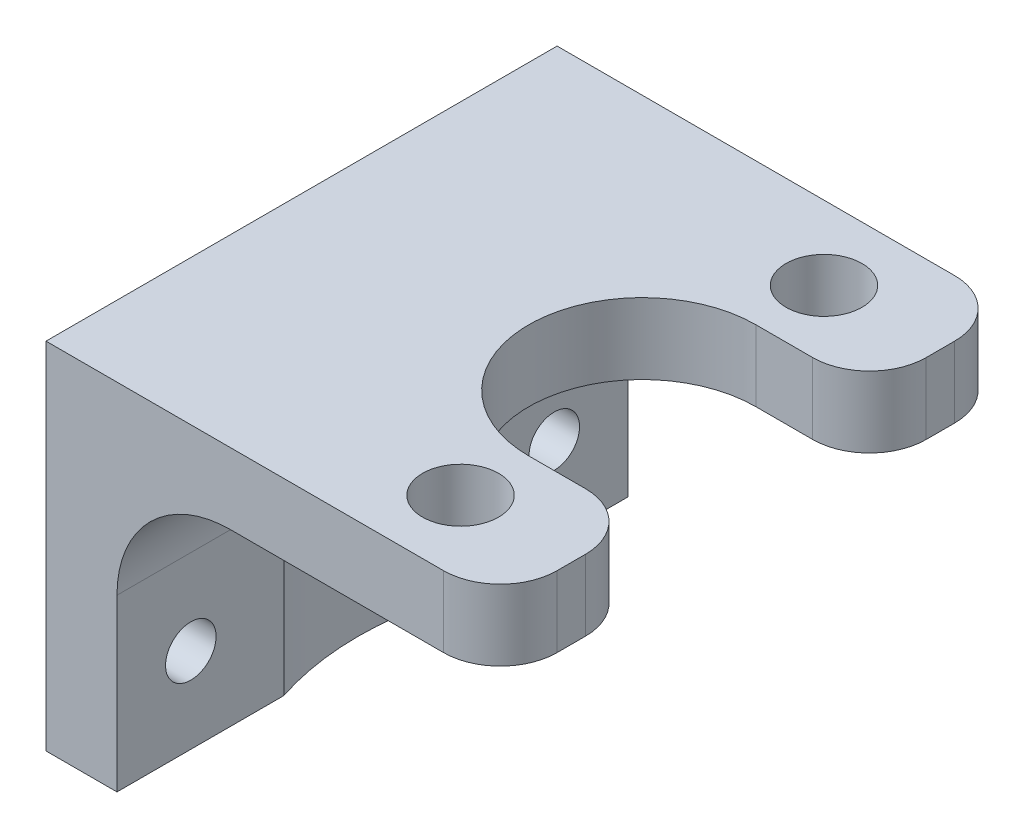
ISO-10303-21;
HEADER;
FILE_DESCRIPTION(('STEP AP214'),'2;1');
FILE_NAME('part.step','',(''),(''),'','','');
FILE_SCHEMA(('AUTOMOTIVE_DESIGN { 1 0 10303 214 1 1 1 1 }'));
ENDSEC;
DATA;
#1=APPLICATION_CONTEXT('core data for automotive mechanical design processes');
#2=APPLICATION_PROTOCOL_DEFINITION('international standard','automotive_design',2000,#1);
#3=PRODUCT_CONTEXT('',#1,'mechanical');
#4=PRODUCT('Part','Part','',(#3));
#5=PRODUCT_RELATED_PRODUCT_CATEGORY('part','',(#4));
#6=PRODUCT_DEFINITION_FORMATION('','',#4);
#7=PRODUCT_DEFINITION_CONTEXT('part definition',#1,'design');
#8=PRODUCT_DEFINITION('design','',#6,#7);
#9=PRODUCT_DEFINITION_SHAPE('','',#8);
#10=(LENGTH_UNIT() NAMED_UNIT(*) SI_UNIT(.MILLI.,.METRE.));
#11=(NAMED_UNIT(*) PLANE_ANGLE_UNIT() SI_UNIT($,.RADIAN.));
#12=(NAMED_UNIT(*) SI_UNIT($,.STERADIAN.) SOLID_ANGLE_UNIT());
#13=UNCERTAINTY_MEASURE_WITH_UNIT(LENGTH_MEASURE(1.E-05),#10,'distance_accuracy_value','');
#14=(GEOMETRIC_REPRESENTATION_CONTEXT(3) GLOBAL_UNCERTAINTY_ASSIGNED_CONTEXT((#13)) GLOBAL_UNIT_ASSIGNED_CONTEXT((#10,
#11,#12)) REPRESENTATION_CONTEXT('',''));
#15=CARTESIAN_POINT('',(0.,0.,0.));
#16=DIRECTION('',(0.,0.,1.));
#17=DIRECTION('',(1.,0.,0.));
#18=AXIS2_PLACEMENT_3D('',#15,#16,#17);
#19=CARTESIAN_POINT('',(-1.905,-5.08,0.));
#20=DIRECTION('',(0.,0.,-1.));
#21=DIRECTION('',(-1.,0.,0.));
#22=AXIS2_PLACEMENT_3D('',#19,#20,#21);
#23=CYLINDRICAL_SURFACE('',#22,5.08);
#24=CARTESIAN_POINT('',(-1.905,0.,10.6065911111912));
#25=CARTESIAN_POINT('',(-1.99596443418149,-1.01329915897046E-06,10.5466887844132));
#26=CARTESIAN_POINT('',(-2.0861340861637,-0.00244322260485966,10.4856266603058));
#27=CARTESIAN_POINT('',(-2.2646893735669,-0.0119611820117931,10.3613396064152));
#28=CARTESIAN_POINT('',(-2.35307545596892,-0.0190357559474637,10.2981152294927));
#29=CARTESIAN_POINT('',(-2.61498521640532,-0.0467997558229165,10.1056446793733));
#30=CARTESIAN_POINT('',(-2.78562618310901,-0.0740314872429836,9.97335996135179));
#31=CARTESIAN_POINT('',(-3.1164525826835,-0.143694699527984,9.70326650060102));
#32=CARTESIAN_POINT('',(-3.27672026630821,-0.185982956643509,9.56552032403289));
#33=CARTESIAN_POINT('',(-3.58800377820172,-0.284111933785825,9.28438076935319));
#34=CARTESIAN_POINT('',(-3.73901429962573,-0.33996033808965,9.14098422802204));
#35=CARTESIAN_POINT('',(-4.06981490398475,-0.47998002386457,8.81128907164102));
#36=CARTESIAN_POINT('',(-4.2467290444534,-0.56773724956672,8.62362562702776));
#37=CARTESIAN_POINT('',(-4.58488811251007,-0.759994574306441,8.24286416123916));
#38=CARTESIAN_POINT('',(-4.74612976084466,-0.864498165227075,8.04976501357092));
#39=CARTESIAN_POINT('',(-5.05379552996643,-1.08901683591521,7.65887541291587));
#40=CARTESIAN_POINT('',(-5.20013779323898,-1.20911013984939,7.46106571408954));
#41=CARTESIAN_POINT('',(-5.47720316470798,-1.46321811310087,7.06357616943074));
#42=CARTESIAN_POINT('',(-5.6079306595154,-1.59722885276305,6.86389686590006));
#43=CARTESIAN_POINT('',(-5.82593306848602,-1.84681048487803,6.51025343082133));
#44=CARTESIAN_POINT('',(-5.91631998386987,-1.95962070319113,6.35624482302585));
#45=CARTESIAN_POINT('',(-6.0879835611807,-2.19380045143656,6.04954609694954));
#46=CARTESIAN_POINT('',(-6.16925753232748,-2.31517249227548,5.89685638031667));
#47=CARTESIAN_POINT('',(-6.32222740764621,-2.56681466743316,5.59532490102736));
#48=CARTESIAN_POINT('',(-6.39396407059434,-2.6970430880394,5.44646911017335));
#49=CARTESIAN_POINT('',(-6.52790918307024,-2.96858646488772,5.15481040322741));
#50=CARTESIAN_POINT('',(-6.59012679801207,-3.10989055607807,5.01200176171065));
#51=CARTESIAN_POINT('',(-6.68913629538562,-3.36765875412946,4.7738275505998));
#52=CARTESIAN_POINT('',(-6.72830227313746,-3.48081904064943,4.67589764730949));
#53=CARTESIAN_POINT('',(-6.80034262995548,-3.71716453324485,4.48969576122306));
#54=CARTESIAN_POINT('',(-6.83321056337989,-3.84035982773388,4.40143371199532));
#55=CARTESIAN_POINT('',(-6.8853065363736,-4.07295302188119,4.25747491891597));
#56=CARTESIAN_POINT('',(-6.90594826794644,-4.18014942163848,4.19879822520508));
#57=CARTESIAN_POINT('',(-6.9408749970461,-4.40258079760138,4.0977333796737));
#58=CARTESIAN_POINT('',(-6.95519658126394,-4.51776491816841,4.05525167697404));
#59=CARTESIAN_POINT('',(-6.97188586213808,-4.70817710280017,4.00530569369846));
#60=CARTESIAN_POINT('',(-6.97673991680374,-4.78128583570145,3.99063981225697));
#61=CARTESIAN_POINT('',(-6.98332612700453,-4.92953586895697,3.97066741499163));
#62=CARTESIAN_POINT('',(-6.98503080272835,-5.00468930761968,3.96544329143358));
#63=CARTESIAN_POINT('',(-6.985,-5.08,3.96557372898299));
#64=B_SPLINE_CURVE_WITH_KNOTS('',3,(#24,#25,#26,#27,#28,#29,#30,#31,#32,#33,#34,#35,#36,#37,#38,
#39,#40,#41,#42,#43,#44,#45,#46,#47,#48,#49,#50,#51,#52,#53,#54,#55,#56,#57,#58,#59,#60,#61,#62,
#63),.UNSPECIFIED.,.F.,.F.,(4,2,2,2,2,2,2,2,2,2,2,2,2,2,2,2,2,2,2,4),(0.,0.326667923463672,
0.653252937509225,1.30511428610583,1.95093362836779,2.5971198018174,3.41324937170282,
4.22954933953037,5.05011615327995,5.87045190272281,6.50377907721026,7.13729276456552,
7.76800549759739,8.39810707448029,8.86169425554034,9.32575338331663,9.69656828582754,
10.0652074805127,10.2887386558922,10.5142111981198),.UNSPECIFIED.);
#65=CARTESIAN_POINT('',(-1.905,0.,10.6065911111912));
#66=VERTEX_POINT('',#65);
#67=CARTESIAN_POINT('',(-6.985,-5.08,3.96557372898299));
#68=VERTEX_POINT('',#67);
#69=EDGE_CURVE('E276',#66,#68,#64,.T.);
#70=ORIENTED_EDGE('',*,*,#69,.F.);
#71=DIRECTION('',(0.,0.,-1.));
#72=VECTOR('',#71,1.);
#73=CARTESIAN_POINT('',(-1.905,0.,0.));
#74=LINE('',#73,#72);
#75=CARTESIAN_POINT('',(-1.905,0.,11.43));
#76=VERTEX_POINT('',#75);
#77=EDGE_CURVE('E259',#76,#66,#74,.T.);
#78=ORIENTED_EDGE('',*,*,#77,.F.);
#79=CARTESIAN_POINT('',(-1.905,-5.08,11.43));
#80=DIRECTION('',(0.,0.,-1.));
#81=DIRECTION('',(-1.,0.,0.));
#82=AXIS2_PLACEMENT_3D('',#79,#80,#81);
#83=CIRCLE('',#82,5.08);
#84=CARTESIAN_POINT('',(-6.985,-5.08,11.43));
#85=VERTEX_POINT('',#84);
#86=EDGE_CURVE('E57',#76,#85,#83,.F.);
#87=ORIENTED_EDGE('',*,*,#86,.T.);
#88=DIRECTION('',(0.,0.,-1.));
#89=VECTOR('',#88,1.);
#90=CARTESIAN_POINT('',(-6.985,-5.08,11.43));
#91=LINE('',#90,#89);
#92=EDGE_CURVE('E262',#68,#85,#91,.F.);
#93=ORIENTED_EDGE('',*,*,#92,.F.);
#94=EDGE_LOOP('',(#70,#78,#87,#93));
#95=FACE_BOUND('',#94,.T.);
#96=ADVANCED_FACE('F49',(#95),#23,.F.);
#97=CARTESIAN_POINT('',(-6.985,-5.08,-3.965573728983));
#98=CARTESIAN_POINT('',(-6.98501243462539,-5.02313654218133,-3.96552254566352));
#99=CARTESIAN_POINT('',(-6.98404577354668,-4.96630906430899,-3.96847685033391));
#100=CARTESIAN_POINT('',(-6.98025489946552,-4.85342921322589,-3.97998947310891));
#101=CARTESIAN_POINT('',(-6.97743547061067,-4.79737522233663,-3.98853335775731));
#102=CARTESIAN_POINT('',(-6.97011176481025,-4.68754197022549,-4.01060201827622));
#103=CARTESIAN_POINT('',(-6.96564184081347,-4.63373964842225,-4.02402515567711));
#104=CARTESIAN_POINT('',(-6.95515507587846,-4.52756835071342,-4.05528297660954));
#105=CARTESIAN_POINT('',(-6.94913716928097,-4.47520038983758,-4.07312069889958));
#106=CARTESIAN_POINT('',(-6.92387138825496,-4.28128746319438,-4.14732822896197));
#107=CARTESIAN_POINT('',(-6.89998881141089,-4.14511330707712,-4.21623301029293));
#108=CARTESIAN_POINT('',(-6.84406366827373,-3.88411093667522,-4.37191441287979));
#109=CARTESIAN_POINT('',(-6.81194043205678,-3.7594124764202,-4.45886599231846));
#110=CARTESIAN_POINT('',(-6.7381720038089,-3.50992767732163,-4.65105394609583));
#111=CARTESIAN_POINT('',(-6.6959486891275,-3.38603922986691,-4.75721703069514));
#112=CARTESIAN_POINT('',(-6.60480659396756,-3.14750738494174,-4.97689626560496));
#113=CARTESIAN_POINT('',(-6.55588024156267,-3.03287467912632,-5.09042065394177));
#114=CARTESIAN_POINT('',(-6.45182327018049,-2.81112600465138,-5.32195246677524));
#115=CARTESIAN_POINT('',(-6.39668962329583,-2.70401374617602,-5.43996206039276));
#116=CARTESIAN_POINT('',(-6.28049732660413,-2.49628912440213,-5.67862113169921));
#117=CARTESIAN_POINT('',(-6.21944083229487,-2.39567441849384,-5.79926963672224));
#118=CARTESIAN_POINT('',(-6.0415104049458,-2.1238094639421,-6.13690828040322));
#119=CARTESIAN_POINT('',(-5.91827619969558,-1.95874436003302,-6.35557115633619));
#120=CARTESIAN_POINT('',(-5.65324384806655,-1.6450062202385,-6.79361271993009));
#121=CARTESIAN_POINT('',(-5.51143298944789,-1.49634453894597,-7.0129917965347));
#122=CARTESIAN_POINT('',(-5.20909683250229,-1.21582506629335,-7.44949327212334));
#123=CARTESIAN_POINT('',(-5.04857786037841,-1.08396162594724,-7.66661640706656));
#124=CARTESIAN_POINT('',(-4.70860032812132,-0.838522265570046,-8.0961883263207));
#125=CARTESIAN_POINT('',(-4.52915346915027,-0.724935155593786,-8.30863990153236));
#126=CARTESIAN_POINT('',(-4.2043466633807,-0.547522091522572,-8.66787017022752));
#127=CARTESIAN_POINT('',(-4.06357055896515,-0.478680721355011,-8.81633321809537));
#128=CARTESIAN_POINT('',(-3.77226558939357,-0.352962332949804,-9.10878550725363));
#129=CARTESIAN_POINT('',(-3.62173573239785,-0.296086533972524,-9.25277429135542));
#130=CARTESIAN_POINT('',(-3.31184578002247,-0.195985100213568,-9.5347074888234));
#131=CARTESIAN_POINT('',(-3.15252041982383,-0.15270973506796,-9.67267229642921));
#132=CARTESIAN_POINT('',(-2.82521002125021,-0.0812364278571495,-9.94195633346605));
#133=CARTESIAN_POINT('',(-2.65723124166651,-0.0530277517689098,-10.0732802335569));
#134=CARTESIAN_POINT('',(-2.39088753474402,-0.0223946207728884,-10.2708183973745));
#135=CARTESIAN_POINT('',(-2.29518650662456,-0.0140796503677234,-10.3397555459607));
#136=CARTESIAN_POINT('',(-2.10163732038624,-0.00288146443852575,-10.4751160628789));
#137=CARTESIAN_POINT('',(-2.00378803305032,-1.17829318203772E-06,-10.5415380566138));
#138=CARTESIAN_POINT('',(-1.90499999999999,0.,-10.6065911111912));
#139=B_SPLINE_CURVE_WITH_KNOTS('',3,(#97,#98,#99,#100,#101,#102,#103,#104,#105,#106,#107,#108,
#109,#110,#111,#112,#113,#114,#115,#116,#117,#118,#119,#120,#121,#122,#123,#124,#125,#126,#127,
#128,#129,#130,#131,#132,#133,#134,#135,#136,#137,#138),.UNSPECIFIED.,.F.,.F.,(4,2,2,2,2,2,2,2,
2,2,2,2,2,2,2,2,2,2,2,2,4),(0.,0.170447919280657,0.340457434671443,0.507111396928136,
0.67388039527551,1.13435083683149,1.59951344248259,2.10431202434874,2.60968561524757,
3.11530680341125,3.62074466665622,4.52081530958416,5.42150513165724,6.32189126173355,
7.2217240023538,7.8687986389446,8.51593917884467,9.16068513310825,9.80497113359638,
10.159530539132,10.5142810031246),.UNSPECIFIED.);
#140=CARTESIAN_POINT('',(-6.985,-5.08,-3.96557372898299));
#141=VERTEX_POINT('',#140);
#142=CARTESIAN_POINT('',(-1.90499999999999,0.,-10.6065911111912));
#143=VERTEX_POINT('',#142);
#144=EDGE_CURVE('E187',#141,#143,#139,.T.);
#145=ORIENTED_EDGE('',*,*,#144,.F.);
#146=CARTESIAN_POINT('',(-6.98499999999999,-5.08,-11.43));
#147=VERTEX_POINT('',#146);
#148=EDGE_CURVE('E186',#147,#141,#91,.F.);
#149=ORIENTED_EDGE('',*,*,#148,.F.);
#150=CARTESIAN_POINT('',(-1.90499999999999,-5.08,-11.43));
#151=DIRECTION('',(0.,0.,1.));
#152=DIRECTION('',(1.,0.,0.));
#153=AXIS2_PLACEMENT_3D('',#150,#151,#152);
#154=CIRCLE('',#153,5.08);
#155=CARTESIAN_POINT('',(-1.90499999999999,0.,-11.43));
#156=VERTEX_POINT('',#155);
#157=EDGE_CURVE('E13',#147,#156,#154,.F.);
#158=ORIENTED_EDGE('',*,*,#157,.T.);
#159=EDGE_CURVE('E263',#143,#156,#74,.T.);
#160=ORIENTED_EDGE('',*,*,#159,.F.);
#161=EDGE_LOOP('',(#145,#149,#158,#160));
#162=FACE_BOUND('',#161,.T.);
#163=ADVANCED_FACE('F300',(#162),#23,.F.);
#164=CARTESIAN_POINT('',(-6.985,-12.7,11.43));
#165=DIRECTION('',(-1.,0.,0.));
#166=DIRECTION('',(0.,0.,1.));
#167=AXIS2_PLACEMENT_3D('',#164,#165,#166);
#168=PLANE('',#167);
#169=CARTESIAN_POINT('',(-6.985,-8.89,8.128));
#170=DIRECTION('',(1.,0.,0.));
#171=DIRECTION('',(0.,0.,-1.));
#172=AXIS2_PLACEMENT_3D('',#169,#170,#171);
#173=CIRCLE('',#172,1.13029999999999);
#174=CARTESIAN_POINT('',(-6.985,-8.89,6.99770000000001));
#175=VERTEX_POINT('',#174);
#176=EDGE_CURVE('E377',#175,#175,#173,.T.);
#177=ORIENTED_EDGE('',*,*,#176,.F.);
#178=EDGE_LOOP('',(#177));
#179=FACE_BOUND('',#178,.T.);
#180=DIRECTION('',(0.,1.,0.));
#181=VECTOR('',#180,1.);
#182=CARTESIAN_POINT('',(-6.985,-12.7,3.96557372898299));
#183=LINE('',#182,#181);
#184=CARTESIAN_POINT('',(-6.985,-12.7,3.96557372898299));
#185=VERTEX_POINT('',#184);
#186=EDGE_CURVE('E64',#68,#185,#183,.F.);
#187=ORIENTED_EDGE('',*,*,#186,.F.);
#188=ORIENTED_EDGE('',*,*,#92,.T.);
#189=DIRECTION('',(0.,1.,0.));
#190=VECTOR('',#189,1.);
#191=CARTESIAN_POINT('',(-6.985,-12.7,11.43));
#192=LINE('',#191,#190);
#193=CARTESIAN_POINT('',(-6.985,-12.7,11.43));
#194=VERTEX_POINT('',#193);
#195=EDGE_CURVE('E197',#194,#85,#192,.T.);
#196=ORIENTED_EDGE('',*,*,#195,.F.);
#197=DIRECTION('',(0.,0.,1.));
#198=VECTOR('',#197,1.);
#199=CARTESIAN_POINT('',(-6.985,-12.7,11.43));
#200=LINE('',#199,#198);
#201=EDGE_CURVE('E194',#185,#194,#200,.T.);
#202=ORIENTED_EDGE('',*,*,#201,.F.);
#203=EDGE_LOOP('',(#187,#188,#196,#202));
#204=FACE_BOUND('',#203,.T.);
#205=ADVANCED_FACE('F275',(#179,#204),#168,.F.);
#206=CARTESIAN_POINT('',(-6.98499999999999,-8.89,-8.128));
#207=DIRECTION('',(1.,0.,0.));
#208=DIRECTION('',(0.,0.,-1.));
#209=AXIS2_PLACEMENT_3D('',#206,#207,#208);
#210=CIRCLE('',#209,1.13029999999999);
#211=CARTESIAN_POINT('',(-6.98499999999999,-8.89,-9.25829999999999));
#212=VERTEX_POINT('',#211);
#213=EDGE_CURVE('E369',#212,#212,#210,.T.);
#214=ORIENTED_EDGE('',*,*,#213,.F.);
#215=EDGE_LOOP('',(#214));
#216=FACE_BOUND('',#215,.T.);
#217=DIRECTION('',(0.,1.,0.));
#218=VECTOR('',#217,1.);
#219=CARTESIAN_POINT('',(-6.985,-12.7,-3.96557372898299));
#220=LINE('',#219,#218);
#221=CARTESIAN_POINT('',(-6.985,-12.7,-3.96557372898299));
#222=VERTEX_POINT('',#221);
#223=EDGE_CURVE('E173',#222,#141,#220,.T.);
#224=ORIENTED_EDGE('',*,*,#223,.F.);
#225=CARTESIAN_POINT('',(-6.98499999999999,-12.7,-11.43));
#226=VERTEX_POINT('',#225);
#227=EDGE_CURVE('E185',#226,#222,#200,.T.);
#228=ORIENTED_EDGE('',*,*,#227,.F.);
#229=DIRECTION('',(0.,1.,0.));
#230=VECTOR('',#229,1.);
#231=CARTESIAN_POINT('',(-6.98499999999999,-12.7,-11.43));
#232=LINE('',#231,#230);
#233=EDGE_CURVE('E215',#226,#147,#232,.T.);
#234=ORIENTED_EDGE('',*,*,#233,.T.);
#235=ORIENTED_EDGE('',*,*,#148,.T.);
#236=EDGE_LOOP('',(#224,#228,#234,#235));
#237=FACE_BOUND('',#236,.T.);
#238=ADVANCED_FACE('F183',(#216,#237),#168,.F.);
#239=CARTESIAN_POINT('',(7.62,3.175,-7.62));
#240=DIRECTION('',(0.,-1.,0.));
#241=DIRECTION('',(0.,0.,-1.));
#242=AXIS2_PLACEMENT_3D('',#239,#240,#241);
#243=CYLINDRICAL_SURFACE('',#242,2.54);
#244=DIRECTION('',(0.,-1.,0.));
#245=VECTOR('',#244,1.);
#246=CARTESIAN_POINT('',(10.16,3.175,-7.62));
#247=LINE('',#246,#245);
#248=CARTESIAN_POINT('',(10.16,3.175,-7.62000000000001));
#249=VERTEX_POINT('',#248);
#250=CARTESIAN_POINT('',(10.16,0.,-7.62000000000001));
#251=VERTEX_POINT('',#250);
#252=EDGE_CURVE('E419',#249,#251,#247,.T.);
#253=ORIENTED_EDGE('',*,*,#252,.F.);
#254=CARTESIAN_POINT('',(7.62,3.175,-7.62));
#255=DIRECTION('',(0.,-1.,0.));
#256=DIRECTION('',(0.,0.,-1.));
#257=AXIS2_PLACEMENT_3D('',#254,#255,#256);
#258=CIRCLE('',#257,2.54);
#259=CARTESIAN_POINT('',(7.62,3.175,-5.08));
#260=VERTEX_POINT('',#259);
#261=EDGE_CURVE('E413',#260,#249,#258,.F.);
#262=ORIENTED_EDGE('',*,*,#261,.F.);
#263=DIRECTION('',(0.,-1.,0.));
#264=VECTOR('',#263,1.);
#265=CARTESIAN_POINT('',(7.62,3.175,-5.08));
#266=LINE('',#265,#264);
#267=CARTESIAN_POINT('',(7.62,0.,-5.08));
#268=VERTEX_POINT('',#267);
#269=EDGE_CURVE('E418',#268,#260,#266,.F.);
#270=ORIENTED_EDGE('',*,*,#269,.F.);
#271=CARTESIAN_POINT('',(7.62,0.,-7.62));
#272=DIRECTION('',(0.,-1.,0.));
#273=DIRECTION('',(0.,0.,-1.));
#274=AXIS2_PLACEMENT_3D('',#271,#272,#273);
#275=CIRCLE('',#274,2.54);
#276=EDGE_CURVE('E249',#251,#268,#275,.T.);
#277=ORIENTED_EDGE('',*,*,#276,.F.);
#278=EDGE_LOOP('',(#253,#262,#270,#277));
#279=FACE_BOUND('',#278,.T.);
#280=ADVANCED_FACE('F345',(#279),#243,.T.);
#281=CARTESIAN_POINT('',(7.62,3.175,7.62));
#282=DIRECTION('',(0.,1.,0.));
#283=DIRECTION('',(0.,0.,1.));
#284=AXIS2_PLACEMENT_3D('',#281,#282,#283);
#285=CYLINDRICAL_SURFACE('',#284,2.54);
#286=DIRECTION('',(0.,1.,0.));
#287=VECTOR('',#286,1.);
#288=CARTESIAN_POINT('',(10.16,3.175,7.62));
#289=LINE('',#288,#287);
#290=CARTESIAN_POINT('',(10.16,0.,7.62));
#291=VERTEX_POINT('',#290);
#292=CARTESIAN_POINT('',(10.16,3.175,7.62));
#293=VERTEX_POINT('',#292);
#294=EDGE_CURVE('E431',#291,#293,#289,.T.);
#295=ORIENTED_EDGE('',*,*,#294,.F.);
#296=CARTESIAN_POINT('',(7.62,0.,7.62));
#297=DIRECTION('',(0.,-1.,0.));
#298=DIRECTION('',(0.,0.,-1.));
#299=AXIS2_PLACEMENT_3D('',#296,#297,#298);
#300=CIRCLE('',#299,2.54);
#301=CARTESIAN_POINT('',(7.62,0.,5.08));
#302=VERTEX_POINT('',#301);
#303=EDGE_CURVE('E426',#302,#291,#300,.T.);
#304=ORIENTED_EDGE('',*,*,#303,.F.);
#305=DIRECTION('',(0.,1.,0.));
#306=VECTOR('',#305,1.);
#307=CARTESIAN_POINT('',(7.62,3.175,5.08));
#308=LINE('',#307,#306);
#309=CARTESIAN_POINT('',(7.62,3.175,5.08));
#310=VERTEX_POINT('',#309);
#311=EDGE_CURVE('E428',#310,#302,#308,.F.);
#312=ORIENTED_EDGE('',*,*,#311,.F.);
#313=CARTESIAN_POINT('',(7.62,3.175,7.62));
#314=DIRECTION('',(0.,-1.,0.));
#315=DIRECTION('',(0.,0.,-1.));
#316=AXIS2_PLACEMENT_3D('',#313,#314,#315);
#317=CIRCLE('',#316,2.54);
#318=EDGE_CURVE('E422',#293,#310,#317,.F.);
#319=ORIENTED_EDGE('',*,*,#318,.F.);
#320=EDGE_LOOP('',(#295,#304,#312,#319));
#321=FACE_BOUND('',#320,.T.);
#322=ADVANCED_FACE('F343',(#321),#285,.T.);
#323=CARTESIAN_POINT('',(10.16,3.175,11.43));
#324=DIRECTION('',(-1.,0.,0.));
#325=DIRECTION('',(0.,0.,1.));
#326=AXIS2_PLACEMENT_3D('',#323,#324,#325);
#327=PLANE('',#326);
#328=DIRECTION('',(0.,0.,-1.));
#329=VECTOR('',#328,1.);
#330=CARTESIAN_POINT('',(10.16,0.,11.43));
#331=LINE('',#330,#329);
#332=CARTESIAN_POINT('',(10.16,0.,8.89));
#333=VERTEX_POINT('',#332);
#334=EDGE_CURVE('E237',#333,#291,#331,.T.);
#335=ORIENTED_EDGE('',*,*,#334,.T.);
#336=ORIENTED_EDGE('',*,*,#294,.T.);
#337=DIRECTION('',(0.,0.,-1.));
#338=VECTOR('',#337,1.);
#339=CARTESIAN_POINT('',(10.16,3.175,11.43));
#340=LINE('',#339,#338);
#341=CARTESIAN_POINT('',(10.16,3.175,8.89));
#342=VERTEX_POINT('',#341);
#343=EDGE_CURVE('E225',#342,#293,#340,.T.);
#344=ORIENTED_EDGE('',*,*,#343,.F.);
#345=DIRECTION('',(0.,-1.,0.));
#346=VECTOR('',#345,1.);
#347=CARTESIAN_POINT('',(10.16,3.175,8.89));
#348=LINE('',#347,#346);
#349=EDGE_CURVE('E442',#342,#333,#348,.T.);
#350=ORIENTED_EDGE('',*,*,#349,.T.);
#351=EDGE_LOOP('',(#335,#336,#344,#350));
#352=FACE_BOUND('',#351,.T.);
#353=ADVANCED_FACE('F335',(#352),#327,.F.);
#354=CARTESIAN_POINT('',(7.62,3.175,8.89));
#355=DIRECTION('',(0.,-1.,0.));
#356=DIRECTION('',(0.,0.,-1.));
#357=AXIS2_PLACEMENT_3D('',#354,#355,#356);
#358=CYLINDRICAL_SURFACE('',#357,2.54);
#359=ORIENTED_EDGE('',*,*,#349,.F.);
#360=CARTESIAN_POINT('',(7.62,3.175,8.89));
#361=DIRECTION('',(0.,-1.,0.));
#362=DIRECTION('',(0.,0.,-1.));
#363=AXIS2_PLACEMENT_3D('',#360,#361,#362);
#364=CIRCLE('',#363,2.54);
#365=CARTESIAN_POINT('',(7.62,3.175,11.43));
#366=VERTEX_POINT('',#365);
#367=EDGE_CURVE('E437',#366,#342,#364,.F.);
#368=ORIENTED_EDGE('',*,*,#367,.F.);
#369=DIRECTION('',(0.,-1.,0.));
#370=VECTOR('',#369,1.);
#371=CARTESIAN_POINT('',(7.62,3.175,11.43));
#372=LINE('',#371,#370);
#373=CARTESIAN_POINT('',(7.62,0.,11.43));
#374=VERTEX_POINT('',#373);
#375=EDGE_CURVE('E439',#374,#366,#372,.F.);
#376=ORIENTED_EDGE('',*,*,#375,.F.);
#377=CARTESIAN_POINT('',(7.62,0.,8.89));
#378=DIRECTION('',(0.,-1.,0.));
#379=DIRECTION('',(0.,0.,-1.));
#380=AXIS2_PLACEMENT_3D('',#377,#378,#379);
#381=CIRCLE('',#380,2.54);
#382=EDGE_CURVE('E434',#333,#374,#381,.T.);
#383=ORIENTED_EDGE('',*,*,#382,.F.);
#384=EDGE_LOOP('',(#359,#368,#376,#383));
#385=FACE_BOUND('',#384,.T.);
#386=ADVANCED_FACE('F338',(#385),#358,.T.);
#387=CARTESIAN_POINT('',(7.62,3.175,-8.89));
#388=DIRECTION('',(0.,1.,0.));
#389=DIRECTION('',(0.,0.,1.));
#390=AXIS2_PLACEMENT_3D('',#387,#388,#389);
#391=CYLINDRICAL_SURFACE('',#390,2.54);
#392=DIRECTION('',(0.,1.,0.));
#393=VECTOR('',#392,1.);
#394=CARTESIAN_POINT('',(10.16,3.175,-8.89));
#395=LINE('',#394,#393);
#396=CARTESIAN_POINT('',(10.16,0.,-8.89));
#397=VERTEX_POINT('',#396);
#398=CARTESIAN_POINT('',(10.16,3.175,-8.89));
#399=VERTEX_POINT('',#398);
#400=EDGE_CURVE('E453',#397,#399,#395,.T.);
#401=ORIENTED_EDGE('',*,*,#400,.F.);
#402=CARTESIAN_POINT('',(7.62,0.,-8.89));
#403=DIRECTION('',(0.,-1.,0.));
#404=DIRECTION('',(0.,0.,-1.));
#405=AXIS2_PLACEMENT_3D('',#402,#403,#404);
#406=CIRCLE('',#405,2.54);
#407=CARTESIAN_POINT('',(7.62000000000001,0.,-11.43));
#408=VERTEX_POINT('',#407);
#409=EDGE_CURVE('E447',#408,#397,#406,.T.);
#410=ORIENTED_EDGE('',*,*,#409,.F.);
#411=DIRECTION('',(0.,1.,0.));
#412=VECTOR('',#411,1.);
#413=CARTESIAN_POINT('',(7.62,3.175,-11.43));
#414=LINE('',#413,#412);
#415=CARTESIAN_POINT('',(7.62000000000001,3.175,-11.43));
#416=VERTEX_POINT('',#415);
#417=EDGE_CURVE('E450',#416,#408,#414,.F.);
#418=ORIENTED_EDGE('',*,*,#417,.F.);
#419=CARTESIAN_POINT('',(7.62,3.175,-8.89));
#420=DIRECTION('',(0.,-1.,0.));
#421=DIRECTION('',(0.,0.,-1.));
#422=AXIS2_PLACEMENT_3D('',#419,#420,#421);
#423=CIRCLE('',#422,2.54);
#424=EDGE_CURVE('E445',#399,#416,#423,.F.);
#425=ORIENTED_EDGE('',*,*,#424,.F.);
#426=EDGE_LOOP('',(#401,#410,#418,#425));
#427=FACE_BOUND('',#426,.T.);
#428=ADVANCED_FACE('F333',(#427),#391,.T.);
#429=EDGE_CURVE('E229',#249,#399,#340,.T.);
#430=ORIENTED_EDGE('',*,*,#429,.F.);
#431=ORIENTED_EDGE('',*,*,#252,.T.);
#432=EDGE_CURVE('E222',#251,#397,#331,.T.);
#433=ORIENTED_EDGE('',*,*,#432,.T.);
#434=ORIENTED_EDGE('',*,*,#400,.T.);
#435=EDGE_LOOP('',(#430,#431,#433,#434));
#436=FACE_BOUND('',#435,.T.);
#437=ADVANCED_FACE('F330',(#436),#327,.F.);
#438=CARTESIAN_POINT('',(-10.16,3.175,-11.43));
#439=DIRECTION('',(0.,0.,1.));
#440=DIRECTION('',(1.,0.,0.));
#441=AXIS2_PLACEMENT_3D('',#438,#439,#440);
#442=PLANE('',#441);
#443=DIRECTION('',(-1.,0.,0.));
#444=VECTOR('',#443,1.);
#445=CARTESIAN_POINT('',(-10.16,3.175,-11.43));
#446=LINE('',#445,#444);
#447=CARTESIAN_POINT('',(-10.16,3.175,-11.43));
#448=VERTEX_POINT('',#447);
#449=EDGE_CURVE('E228',#416,#448,#446,.T.);
#450=ORIENTED_EDGE('',*,*,#449,.F.);
#451=ORIENTED_EDGE('',*,*,#417,.T.);
#452=DIRECTION('',(-1.,0.,0.));
#453=VECTOR('',#452,1.);
#454=CARTESIAN_POINT('',(-10.16,0.,-11.43));
#455=LINE('',#454,#453);
#456=EDGE_CURVE('E240',#408,#156,#455,.T.);
#457=ORIENTED_EDGE('',*,*,#456,.T.);
#458=ORIENTED_EDGE('',*,*,#157,.F.);
#459=ORIENTED_EDGE('',*,*,#233,.F.);
#460=DIRECTION('',(1.,0.,0.));
#461=VECTOR('',#460,1.);
#462=CARTESIAN_POINT('',(-10.16,-12.7,-11.43));
#463=LINE('',#462,#461);
#464=CARTESIAN_POINT('',(-10.16,-12.7,-11.43));
#465=VERTEX_POINT('',#464);
#466=EDGE_CURVE('E192',#465,#226,#463,.T.);
#467=ORIENTED_EDGE('',*,*,#466,.F.);
#468=DIRECTION('',(0.,-1.,0.));
#469=VECTOR('',#468,1.);
#470=CARTESIAN_POINT('',(-10.16,3.175,-11.43));
#471=LINE('',#470,#469);
#472=EDGE_CURVE('E456',#448,#465,#471,.T.);
#473=ORIENTED_EDGE('',*,*,#472,.F.);
#474=EDGE_LOOP('',(#450,#451,#457,#458,#459,#467,#473));
#475=FACE_BOUND('',#474,.T.);
#476=ADVANCED_FACE('F326',(#475),#442,.F.);
#477=CARTESIAN_POINT('',(-10.16,3.175,11.43));
#478=DIRECTION('',(1.,0.,0.));
#479=DIRECTION('',(0.,0.,-1.));
#480=AXIS2_PLACEMENT_3D('',#477,#478,#479);
#481=PLANE('',#480);
#482=CARTESIAN_POINT('',(-10.16,-8.89,8.128));
#483=DIRECTION('',(1.,0.,0.));
#484=DIRECTION('',(0.,0.,-1.));
#485=AXIS2_PLACEMENT_3D('',#482,#483,#484);
#486=CIRCLE('',#485,1.1303);
#487=CARTESIAN_POINT('',(-10.16,-8.89,6.9977));
#488=VERTEX_POINT('',#487);
#489=EDGE_CURVE('E374',#488,#488,#486,.T.);
#490=ORIENTED_EDGE('',*,*,#489,.T.);
#491=EDGE_LOOP('',(#490));
#492=FACE_BOUND('',#491,.T.);
#493=CARTESIAN_POINT('',(-10.16,-8.89,-8.128));
#494=DIRECTION('',(1.,0.,0.));
#495=DIRECTION('',(0.,0.,-1.));
#496=AXIS2_PLACEMENT_3D('',#493,#494,#495);
#497=CIRCLE('',#496,1.1303);
#498=CARTESIAN_POINT('',(-10.16,-8.89,-9.2583));
#499=VERTEX_POINT('',#498);
#500=EDGE_CURVE('E366',#499,#499,#497,.T.);
#501=ORIENTED_EDGE('',*,*,#500,.T.);
#502=EDGE_LOOP('',(#501));
#503=FACE_BOUND('',#502,.T.);
#504=ORIENTED_EDGE('',*,*,#472,.T.);
#505=DIRECTION('',(0.,0.,-1.));
#506=VECTOR('',#505,1.);
#507=CARTESIAN_POINT('',(-10.16,-12.7,11.43));
#508=LINE('',#507,#506);
#509=CARTESIAN_POINT('',(-10.16,-12.7,11.43));
#510=VERTEX_POINT('',#509);
#511=EDGE_CURVE('E278',#510,#465,#508,.T.);
#512=ORIENTED_EDGE('',*,*,#511,.F.);
#513=DIRECTION('',(0.,-1.,0.));
#514=VECTOR('',#513,1.);
#515=CARTESIAN_POINT('',(-10.16,3.175,11.43));
#516=LINE('',#515,#514);
#517=CARTESIAN_POINT('',(-10.16,3.175,11.43));
#518=VERTEX_POINT('',#517);
#519=EDGE_CURVE('E236',#518,#510,#516,.T.);
#520=ORIENTED_EDGE('',*,*,#519,.F.);
#521=DIRECTION('',(0.,0.,1.));
#522=VECTOR('',#521,1.);
#523=CARTESIAN_POINT('',(-10.16,3.175,11.43));
#524=LINE('',#523,#522);
#525=EDGE_CURVE('E231',#448,#518,#524,.T.);
#526=ORIENTED_EDGE('',*,*,#525,.F.);
#527=EDGE_LOOP('',(#504,#512,#520,#526));
#528=FACE_BOUND('',#527,.T.);
#529=ADVANCED_FACE('F323',(#492,#503,#528),#481,.F.);
#530=CARTESIAN_POINT('',(-10.16,3.175,11.43));
#531=DIRECTION('',(0.,0.,-1.));
#532=DIRECTION('',(-1.,0.,0.));
#533=AXIS2_PLACEMENT_3D('',#530,#531,#532);
#534=PLANE('',#533);
#535=ORIENTED_EDGE('',*,*,#86,.F.);
#536=DIRECTION('',(1.,0.,0.));
#537=VECTOR('',#536,1.);
#538=CARTESIAN_POINT('',(-10.16,0.,11.43));
#539=LINE('',#538,#537);
#540=EDGE_CURVE('E248',#76,#374,#539,.T.);
#541=ORIENTED_EDGE('',*,*,#540,.T.);
#542=ORIENTED_EDGE('',*,*,#375,.T.);
#543=DIRECTION('',(1.,0.,0.));
#544=VECTOR('',#543,1.);
#545=CARTESIAN_POINT('',(-10.16,3.175,11.43));
#546=LINE('',#545,#544);
#547=EDGE_CURVE('E233',#518,#366,#546,.T.);
#548=ORIENTED_EDGE('',*,*,#547,.F.);
#549=ORIENTED_EDGE('',*,*,#519,.T.);
#550=DIRECTION('',(-1.,0.,0.));
#551=VECTOR('',#550,1.);
#552=CARTESIAN_POINT('',(-10.16,-12.7,11.43));
#553=LINE('',#552,#551);
#554=EDGE_CURVE('E193',#194,#510,#553,.T.);
#555=ORIENTED_EDGE('',*,*,#554,.F.);
#556=ORIENTED_EDGE('',*,*,#195,.T.);
#557=EDGE_LOOP('',(#535,#541,#542,#548,#549,#555,#556));
#558=FACE_BOUND('',#557,.T.);
#559=ADVANCED_FACE('F273',(#558),#534,.F.);
#560=CARTESIAN_POINT('',(0.,3.175,0.));
#561=DIRECTION('',(0.,-1.,0.));
#562=DIRECTION('',(0.,0.,-1.));
#563=AXIS2_PLACEMENT_3D('',#560,#561,#562);
#564=PLANE('',#563);
#565=CARTESIAN_POINT('',(5.08,3.175,8.128));
#566=DIRECTION('',(0.,-1.,0.));
#567=DIRECTION('',(0.,0.,-1.));
#568=AXIS2_PLACEMENT_3D('',#565,#566,#567);
#569=CIRCLE('',#568,1.7);
#570=CARTESIAN_POINT('',(5.08,3.175,6.428));
#571=VERTEX_POINT('',#570);
#572=EDGE_CURVE('E386',#571,#571,#569,.T.);
#573=ORIENTED_EDGE('',*,*,#572,.T.);
#574=EDGE_LOOP('',(#573));
#575=FACE_BOUND('',#574,.T.);
#576=CARTESIAN_POINT('',(5.08,3.175,-8.128));
#577=DIRECTION('',(0.,-1.,0.));
#578=DIRECTION('',(0.,0.,-1.));
#579=AXIS2_PLACEMENT_3D('',#576,#577,#578);
#580=CIRCLE('',#579,1.7);
#581=CARTESIAN_POINT('',(5.08,3.175,-9.828));
#582=VERTEX_POINT('',#581);
#583=EDGE_CURVE('E380',#582,#582,#580,.T.);
#584=ORIENTED_EDGE('',*,*,#583,.T.);
#585=EDGE_LOOP('',(#584));
#586=FACE_BOUND('',#585,.T.);
#587=DIRECTION('',(1.,0.,0.));
#588=VECTOR('',#587,1.);
#589=CARTESIAN_POINT('',(5.08,3.175,-5.08));
#590=LINE('',#589,#588);
#591=CARTESIAN_POINT('',(5.08,3.175,-5.08));
#592=VERTEX_POINT('',#591);
#593=EDGE_CURVE('E205',#592,#260,#590,.T.);
#594=ORIENTED_EDGE('',*,*,#593,.T.);
#595=ORIENTED_EDGE('',*,*,#261,.T.);
#596=ORIENTED_EDGE('',*,*,#429,.T.);
#597=ORIENTED_EDGE('',*,*,#424,.T.);
#598=ORIENTED_EDGE('',*,*,#449,.T.);
#599=ORIENTED_EDGE('',*,*,#525,.T.);
#600=ORIENTED_EDGE('',*,*,#547,.T.);
#601=ORIENTED_EDGE('',*,*,#367,.T.);
#602=ORIENTED_EDGE('',*,*,#343,.T.);
#603=ORIENTED_EDGE('',*,*,#318,.T.);
#604=DIRECTION('',(-1.,0.,0.));
#605=VECTOR('',#604,1.);
#606=CARTESIAN_POINT('',(5.08,3.175,5.08));
#607=LINE('',#606,#605);
#608=CARTESIAN_POINT('',(5.08,3.175,5.08));
#609=VERTEX_POINT('',#608);
#610=EDGE_CURVE('E209',#310,#609,#607,.T.);
#611=ORIENTED_EDGE('',*,*,#610,.T.);
#612=CARTESIAN_POINT('',(5.08,3.175,0.));
#613=DIRECTION('',(0.,-1.,0.));
#614=DIRECTION('',(0.,0.,-1.));
#615=AXIS2_PLACEMENT_3D('',#612,#613,#614);
#616=CIRCLE('',#615,5.08);
#617=EDGE_CURVE('E202',#609,#592,#616,.T.);
#618=ORIENTED_EDGE('',*,*,#617,.T.);
#619=EDGE_LOOP('',(#594,#595,#596,#597,#598,#599,#600,#601,#602,#603,#611,#618));
#620=FACE_BOUND('',#619,.T.);
#621=ADVANCED_FACE('F314',(#575,#586,#620),#564,.F.);
#622=CARTESIAN_POINT('',(0.,0.,0.));
#623=DIRECTION('',(0.,-1.,0.));
#624=DIRECTION('',(0.,0.,-1.));
#625=AXIS2_PLACEMENT_3D('',#622,#623,#624);
#626=PLANE('',#625);
#627=CARTESIAN_POINT('',(5.08,0.,8.128));
#628=DIRECTION('',(0.,-1.,0.));
#629=DIRECTION('',(0.,0.,-1.));
#630=AXIS2_PLACEMENT_3D('',#627,#628,#629);
#631=CIRCLE('',#630,1.7);
#632=CARTESIAN_POINT('',(5.08,0.,6.428));
#633=VERTEX_POINT('',#632);
#634=EDGE_CURVE('E389',#633,#633,#631,.T.);
#635=ORIENTED_EDGE('',*,*,#634,.F.);
#636=EDGE_LOOP('',(#635));
#637=FACE_BOUND('',#636,.T.);
#638=CARTESIAN_POINT('',(5.08,0.,-8.128));
#639=DIRECTION('',(0.,-1.,0.));
#640=DIRECTION('',(0.,0.,-1.));
#641=AXIS2_PLACEMENT_3D('',#638,#639,#640);
#642=CIRCLE('',#641,1.7);
#643=CARTESIAN_POINT('',(5.08,0.,-9.828));
#644=VERTEX_POINT('',#643);
#645=EDGE_CURVE('E383',#644,#644,#642,.T.);
#646=ORIENTED_EDGE('',*,*,#645,.F.);
#647=EDGE_LOOP('',(#646));
#648=FACE_BOUND('',#647,.T.);
#649=ORIENTED_EDGE('',*,*,#77,.T.);
#650=CARTESIAN_POINT('',(5.08,0.,0.));
#651=DIRECTION('',(0.,-1.,0.));
#652=DIRECTION('',(0.,0.,-1.));
#653=AXIS2_PLACEMENT_3D('',#650,#651,#652);
#654=CIRCLE('',#653,12.7);
#655=EDGE_CURVE('E178',#66,#143,#654,.T.);
#656=ORIENTED_EDGE('',*,*,#655,.T.);
#657=ORIENTED_EDGE('',*,*,#159,.T.);
#658=ORIENTED_EDGE('',*,*,#456,.F.);
#659=ORIENTED_EDGE('',*,*,#409,.T.);
#660=ORIENTED_EDGE('',*,*,#432,.F.);
#661=ORIENTED_EDGE('',*,*,#276,.T.);
#662=DIRECTION('',(1.,0.,0.));
#663=VECTOR('',#662,1.);
#664=CARTESIAN_POINT('',(5.08,0.,-5.08));
#665=LINE('',#664,#663);
#666=CARTESIAN_POINT('',(5.08,0.,-5.08));
#667=VERTEX_POINT('',#666);
#668=EDGE_CURVE('E214',#667,#268,#665,.T.);
#669=ORIENTED_EDGE('',*,*,#668,.F.);
#670=CARTESIAN_POINT('',(5.08,0.,0.));
#671=DIRECTION('',(0.,-1.,0.));
#672=DIRECTION('',(0.,0.,-1.));
#673=AXIS2_PLACEMENT_3D('',#670,#671,#672);
#674=CIRCLE('',#673,5.08);
#675=CARTESIAN_POINT('',(5.08,0.,5.08));
#676=VERTEX_POINT('',#675);
#677=EDGE_CURVE('E212',#676,#667,#674,.T.);
#678=ORIENTED_EDGE('',*,*,#677,.F.);
#679=DIRECTION('',(-1.,0.,0.));
#680=VECTOR('',#679,1.);
#681=CARTESIAN_POINT('',(5.08,0.,5.08));
#682=LINE('',#681,#680);
#683=EDGE_CURVE('E206',#302,#676,#682,.T.);
#684=ORIENTED_EDGE('',*,*,#683,.F.);
#685=ORIENTED_EDGE('',*,*,#303,.T.);
#686=ORIENTED_EDGE('',*,*,#334,.F.);
#687=ORIENTED_EDGE('',*,*,#382,.T.);
#688=ORIENTED_EDGE('',*,*,#540,.F.);
#689=EDGE_LOOP('',(#649,#656,#657,#658,#659,#660,#661,#669,#678,#684,#685,#686,#687,#688));
#690=FACE_BOUND('',#689,.T.);
#691=ADVANCED_FACE('F312',(#637,#648,#690),#626,.T.);
#692=CARTESIAN_POINT('',(5.08,3.175,0.));
#693=DIRECTION('',(0.,-1.,0.));
#694=DIRECTION('',(0.,0.,-1.));
#695=AXIS2_PLACEMENT_3D('',#692,#693,#694);
#696=CYLINDRICAL_SURFACE('',#695,5.08);
#697=ORIENTED_EDGE('',*,*,#677,.T.);
#698=DIRECTION('',(0.,-1.,0.));
#699=VECTOR('',#698,1.);
#700=CARTESIAN_POINT('',(5.08,3.175,-5.08));
#701=LINE('',#700,#699);
#702=EDGE_CURVE('E211',#592,#667,#701,.T.);
#703=ORIENTED_EDGE('',*,*,#702,.F.);
#704=ORIENTED_EDGE('',*,*,#617,.F.);
#705=DIRECTION('',(0.,-1.,0.));
#706=VECTOR('',#705,1.);
#707=CARTESIAN_POINT('',(5.08,3.175,5.08));
#708=LINE('',#707,#706);
#709=EDGE_CURVE('E219',#609,#676,#708,.T.);
#710=ORIENTED_EDGE('',*,*,#709,.T.);
#711=EDGE_LOOP('',(#697,#703,#704,#710));
#712=FACE_BOUND('',#711,.T.);
#713=ADVANCED_FACE('F305',(#712),#696,.F.);
#714=CARTESIAN_POINT('',(5.08,3.175,5.08));
#715=DIRECTION('',(0.,0.,1.));
#716=DIRECTION('',(1.,0.,0.));
#717=AXIS2_PLACEMENT_3D('',#714,#715,#716);
#718=PLANE('',#717);
#719=ORIENTED_EDGE('',*,*,#610,.F.);
#720=ORIENTED_EDGE('',*,*,#311,.T.);
#721=ORIENTED_EDGE('',*,*,#683,.T.);
#722=ORIENTED_EDGE('',*,*,#709,.F.);
#723=EDGE_LOOP('',(#719,#720,#721,#722));
#724=FACE_BOUND('',#723,.T.);
#725=ADVANCED_FACE('F302',(#724),#718,.F.);
#726=CARTESIAN_POINT('',(5.08,3.175,-5.08));
#727=DIRECTION('',(0.,0.,-1.));
#728=DIRECTION('',(-1.,0.,0.));
#729=AXIS2_PLACEMENT_3D('',#726,#727,#728);
#730=PLANE('',#729);
#731=ORIENTED_EDGE('',*,*,#668,.T.);
#732=ORIENTED_EDGE('',*,*,#269,.T.);
#733=ORIENTED_EDGE('',*,*,#593,.F.);
#734=ORIENTED_EDGE('',*,*,#702,.T.);
#735=EDGE_LOOP('',(#731,#732,#733,#734));
#736=FACE_BOUND('',#735,.T.);
#737=ADVANCED_FACE('F297',(#736),#730,.F.);
#738=CARTESIAN_POINT('',(0.,-12.7,0.));
#739=DIRECTION('',(0.,-1.,0.));
#740=DIRECTION('',(0.,0.,-1.));
#741=AXIS2_PLACEMENT_3D('',#738,#739,#740);
#742=PLANE('',#741);
#743=ORIENTED_EDGE('',*,*,#227,.T.);
#744=CARTESIAN_POINT('',(5.08,-12.7,0.));
#745=DIRECTION('',(0.,-1.,0.));
#746=DIRECTION('',(0.,0.,-1.));
#747=AXIS2_PLACEMENT_3D('',#744,#745,#746);
#748=CIRCLE('',#747,12.7);
#749=EDGE_CURVE('E170',#185,#222,#748,.T.);
#750=ORIENTED_EDGE('',*,*,#749,.F.);
#751=ORIENTED_EDGE('',*,*,#201,.T.);
#752=ORIENTED_EDGE('',*,*,#554,.T.);
#753=ORIENTED_EDGE('',*,*,#511,.T.);
#754=ORIENTED_EDGE('',*,*,#466,.T.);
#755=EDGE_LOOP('',(#743,#750,#751,#752,#753,#754));
#756=FACE_BOUND('',#755,.T.);
#757=ADVANCED_FACE('F189',(#756),#742,.T.);
#758=CARTESIAN_POINT('',(5.08,-12.7,0.));
#759=DIRECTION('',(0.,1.,0.));
#760=DIRECTION('',(0.,0.,1.));
#761=AXIS2_PLACEMENT_3D('',#758,#759,#760);
#762=CYLINDRICAL_SURFACE('',#761,12.7);
#763=ORIENTED_EDGE('',*,*,#69,.T.);
#764=ORIENTED_EDGE('',*,*,#186,.T.);
#765=ORIENTED_EDGE('',*,*,#749,.T.);
#766=ORIENTED_EDGE('',*,*,#223,.T.);
#767=ORIENTED_EDGE('',*,*,#144,.T.);
#768=ORIENTED_EDGE('',*,*,#655,.F.);
#769=EDGE_LOOP('',(#763,#764,#765,#766,#767,#768));
#770=FACE_BOUND('',#769,.T.);
#771=ADVANCED_FACE('F172',(#770),#762,.F.);
#772=CARTESIAN_POINT('',(-6.985,-8.89,-8.128));
#773=DIRECTION('',(1.,0.,0.));
#774=DIRECTION('',(0.,0.,-1.));
#775=AXIS2_PLACEMENT_3D('',#772,#773,#774);
#776=CYLINDRICAL_SURFACE('',#775,1.13029999999999);
#777=ORIENTED_EDGE('',*,*,#500,.F.);
#778=EDGE_LOOP('',(#777));
#779=FACE_BOUND('',#778,.T.);
#780=ORIENTED_EDGE('',*,*,#213,.T.);
#781=EDGE_LOOP('',(#780));
#782=FACE_BOUND('',#781,.T.);
#783=ADVANCED_FACE('F292',(#779,#782),#776,.F.);
#784=CARTESIAN_POINT('',(-6.985,-8.89,8.128));
#785=DIRECTION('',(1.,0.,0.));
#786=DIRECTION('',(0.,0.,-1.));
#787=AXIS2_PLACEMENT_3D('',#784,#785,#786);
#788=CYLINDRICAL_SURFACE('',#787,1.13029999999999);
#789=ORIENTED_EDGE('',*,*,#489,.F.);
#790=EDGE_LOOP('',(#789));
#791=FACE_BOUND('',#790,.T.);
#792=ORIENTED_EDGE('',*,*,#176,.T.);
#793=EDGE_LOOP('',(#792));
#794=FACE_BOUND('',#793,.T.);
#795=ADVANCED_FACE('F399',(#791,#794),#788,.F.);
#796=CARTESIAN_POINT('',(5.08,0.,-8.128));
#797=DIRECTION('',(0.,-1.,0.));
#798=DIRECTION('',(0.,0.,-1.));
#799=AXIS2_PLACEMENT_3D('',#796,#797,#798);
#800=CYLINDRICAL_SURFACE('',#799,1.7);
#801=ORIENTED_EDGE('',*,*,#583,.F.);
#802=EDGE_LOOP('',(#801));
#803=FACE_BOUND('',#802,.T.);
#804=ORIENTED_EDGE('',*,*,#645,.T.);
#805=EDGE_LOOP('',(#804));
#806=FACE_BOUND('',#805,.T.);
#807=ADVANCED_FACE('F397',(#803,#806),#800,.F.);
#808=CARTESIAN_POINT('',(5.08,0.,8.128));
#809=DIRECTION('',(0.,-1.,0.));
#810=DIRECTION('',(0.,0.,-1.));
#811=AXIS2_PLACEMENT_3D('',#808,#809,#810);
#812=CYLINDRICAL_SURFACE('',#811,1.7);
#813=ORIENTED_EDGE('',*,*,#572,.F.);
#814=EDGE_LOOP('',(#813));
#815=FACE_BOUND('',#814,.T.);
#816=ORIENTED_EDGE('',*,*,#634,.T.);
#817=EDGE_LOOP('',(#816));
#818=FACE_BOUND('',#817,.T.);
#819=ADVANCED_FACE('F393',(#815,#818),#812,.F.);
#820=CLOSED_SHELL('',(#96,#163,#205,#238,#280,#322,#353,#386,#428,#437,#476,#529,#559,#621,#691,
#713,#725,#737,#757,#771,#783,#795,#807,#819));
#821=MANIFOLD_SOLID_BREP('B2',#820);
#822=ADVANCED_BREP_SHAPE_REPRESENTATION('',(#18,#821),#14);
#823=SHAPE_DEFINITION_REPRESENTATION(#9,#822);
ENDSEC;
END-ISO-10303-21;
